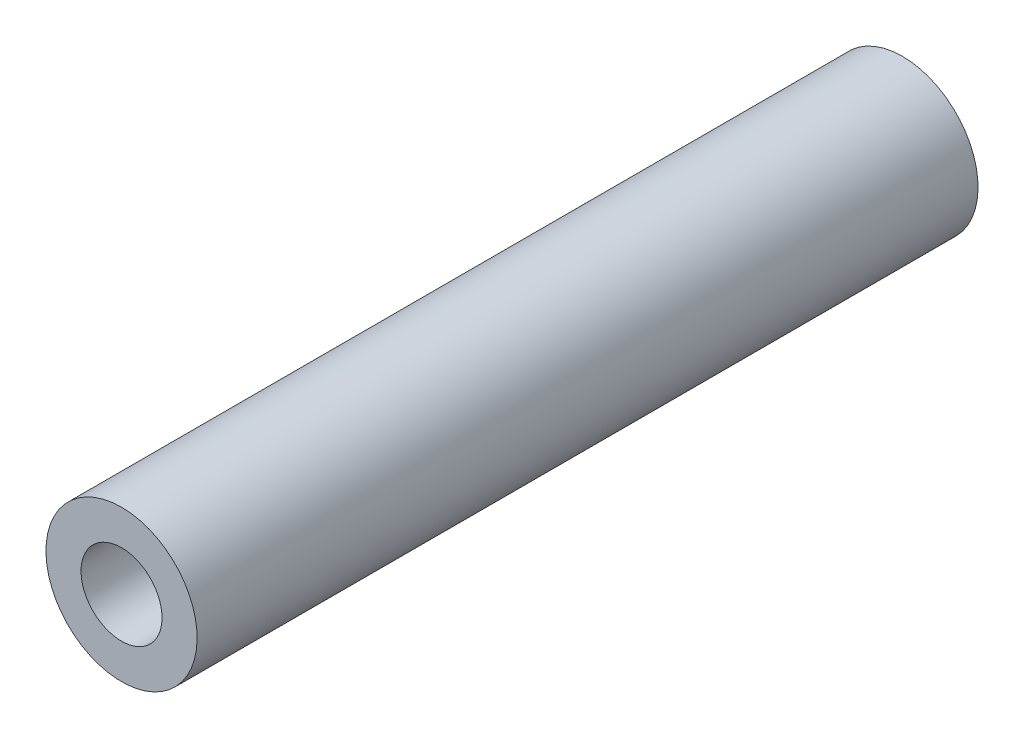
ISO-10303-21;
HEADER;
FILE_DESCRIPTION(('STEP AP214'),'2;1');
FILE_NAME('part.step','',(''),(''),'','','');
FILE_SCHEMA(('AUTOMOTIVE_DESIGN { 1 0 10303 214 1 1 1 1 }'));
ENDSEC;
DATA;
#1=APPLICATION_CONTEXT('core data for automotive mechanical design processes');
#2=APPLICATION_PROTOCOL_DEFINITION('international standard','automotive_design',2000,#1);
#3=PRODUCT_CONTEXT('',#1,'mechanical');
#4=PRODUCT('Part','Part','',(#3));
#5=PRODUCT_RELATED_PRODUCT_CATEGORY('part','',(#4));
#6=PRODUCT_DEFINITION_FORMATION('','',#4);
#7=PRODUCT_DEFINITION_CONTEXT('part definition',#1,'design');
#8=PRODUCT_DEFINITION('design','',#6,#7);
#9=PRODUCT_DEFINITION_SHAPE('','',#8);
#10=(LENGTH_UNIT() NAMED_UNIT(*) SI_UNIT(.MILLI.,.METRE.));
#11=(NAMED_UNIT(*) PLANE_ANGLE_UNIT() SI_UNIT($,.RADIAN.));
#12=(NAMED_UNIT(*) SI_UNIT($,.STERADIAN.) SOLID_ANGLE_UNIT());
#13=UNCERTAINTY_MEASURE_WITH_UNIT(LENGTH_MEASURE(1.E-05),#10,'distance_accuracy_value','');
#14=(GEOMETRIC_REPRESENTATION_CONTEXT(3) GLOBAL_UNCERTAINTY_ASSIGNED_CONTEXT((#13)) GLOBAL_UNIT_ASSIGNED_CONTEXT((#10,
#11,#12)) REPRESENTATION_CONTEXT('',''));
#15=CARTESIAN_POINT('',(0.,0.,0.));
#16=DIRECTION('',(0.,0.,1.));
#17=DIRECTION('',(1.,0.,0.));
#18=AXIS2_PLACEMENT_3D('',#15,#16,#17);
#19=CARTESIAN_POINT('',(0.,0.,24.60625));
#20=DIRECTION('',(0.,0.,-1.));
#21=DIRECTION('',(0.,1.,0.));
#22=AXIS2_PLACEMENT_3D('',#19,#20,#21);
#23=CYLINDRICAL_SURFACE('',#22,2.5527);
#24=CARTESIAN_POINT('',(0.,0.,-24.60625));
#25=DIRECTION('',(0.,0.,-1.));
#26=DIRECTION('',(0.,1.,0.));
#27=AXIS2_PLACEMENT_3D('',#24,#25,#26);
#28=CIRCLE('',#27,2.5527);
#29=CARTESIAN_POINT('',(0.,2.5527,-24.60625));
#30=VERTEX_POINT('',#29);
#31=EDGE_CURVE('E27',#30,#30,#28,.T.);
#32=ORIENTED_EDGE('',*,*,#31,.T.);
#33=EDGE_LOOP('',(#32));
#34=FACE_BOUND('',#33,.T.);
#35=CARTESIAN_POINT('',(0.,0.,24.60625));
#36=DIRECTION('',(0.,0.,-1.));
#37=DIRECTION('',(0.,1.,0.));
#38=AXIS2_PLACEMENT_3D('',#35,#36,#37);
#39=CIRCLE('',#38,2.5527);
#40=CARTESIAN_POINT('',(0.,2.5527,24.60625));
#41=VERTEX_POINT('',#40);
#42=EDGE_CURVE('E18',#41,#41,#39,.T.);
#43=ORIENTED_EDGE('',*,*,#42,.F.);
#44=EDGE_LOOP('',(#43));
#45=FACE_BOUND('',#44,.T.);
#46=ADVANCED_FACE('F15',(#34,#45),#23,.F.);
#47=CARTESIAN_POINT('',(0.,0.,24.60625));
#48=DIRECTION('',(0.,0.,1.));
#49=DIRECTION('',(0.,-1.,0.));
#50=AXIS2_PLACEMENT_3D('',#47,#48,#49);
#51=PLANE('',#50);
#52=ORIENTED_EDGE('',*,*,#42,.T.);
#53=EDGE_LOOP('',(#52));
#54=FACE_BOUND('',#53,.T.);
#55=CARTESIAN_POINT('',(0.,0.,24.60625));
#56=DIRECTION('',(0.,0.,-1.));
#57=DIRECTION('',(0.,1.,0.));
#58=AXIS2_PLACEMENT_3D('',#55,#56,#57);
#59=CIRCLE('',#58,4.76250000000001);
#60=CARTESIAN_POINT('',(0.,4.76250000000001,24.60625));
#61=VERTEX_POINT('',#60);
#62=EDGE_CURVE('E22',#61,#61,#59,.T.);
#63=ORIENTED_EDGE('',*,*,#62,.F.);
#64=EDGE_LOOP('',(#63));
#65=FACE_BOUND('',#64,.T.);
#66=ADVANCED_FACE('F35',(#54,#65),#51,.T.);
#67=CARTESIAN_POINT('',(0.,0.,-24.60625));
#68=DIRECTION('',(0.,0.,1.));
#69=DIRECTION('',(0.,-1.,0.));
#70=AXIS2_PLACEMENT_3D('',#67,#68,#69);
#71=PLANE('',#70);
#72=ORIENTED_EDGE('',*,*,#31,.F.);
#73=EDGE_LOOP('',(#72));
#74=FACE_BOUND('',#73,.T.);
#75=CARTESIAN_POINT('',(0.,0.,-24.60625));
#76=DIRECTION('',(0.,0.,-1.));
#77=DIRECTION('',(0.,1.,0.));
#78=AXIS2_PLACEMENT_3D('',#75,#76,#77);
#79=CIRCLE('',#78,4.76250000000001);
#80=CARTESIAN_POINT('',(0.,4.76250000000001,-24.60625));
#81=VERTEX_POINT('',#80);
#82=EDGE_CURVE('E9',#81,#81,#79,.F.);
#83=ORIENTED_EDGE('',*,*,#82,.F.);
#84=EDGE_LOOP('',(#83));
#85=FACE_BOUND('',#84,.T.);
#86=ADVANCED_FACE('F42',(#74,#85),#71,.F.);
#87=CARTESIAN_POINT('',(0.,0.,24.60625));
#88=DIRECTION('',(0.,0.,-1.));
#89=DIRECTION('',(0.,1.,0.));
#90=AXIS2_PLACEMENT_3D('',#87,#88,#89);
#91=CYLINDRICAL_SURFACE('',#90,4.76250000000001);
#92=ORIENTED_EDGE('',*,*,#82,.T.);
#93=EDGE_LOOP('',(#92));
#94=FACE_BOUND('',#93,.T.);
#95=ORIENTED_EDGE('',*,*,#62,.T.);
#96=EDGE_LOOP('',(#95));
#97=FACE_BOUND('',#96,.T.);
#98=ADVANCED_FACE('F43',(#94,#97),#91,.T.);
#99=CLOSED_SHELL('',(#46,#66,#86,#98));
#100=MANIFOLD_SOLID_BREP('B1',#99);
#101=ADVANCED_BREP_SHAPE_REPRESENTATION('',(#18,#100),#14);
#102=SHAPE_DEFINITION_REPRESENTATION(#9,#101);
ENDSEC;
END-ISO-10303-21;
